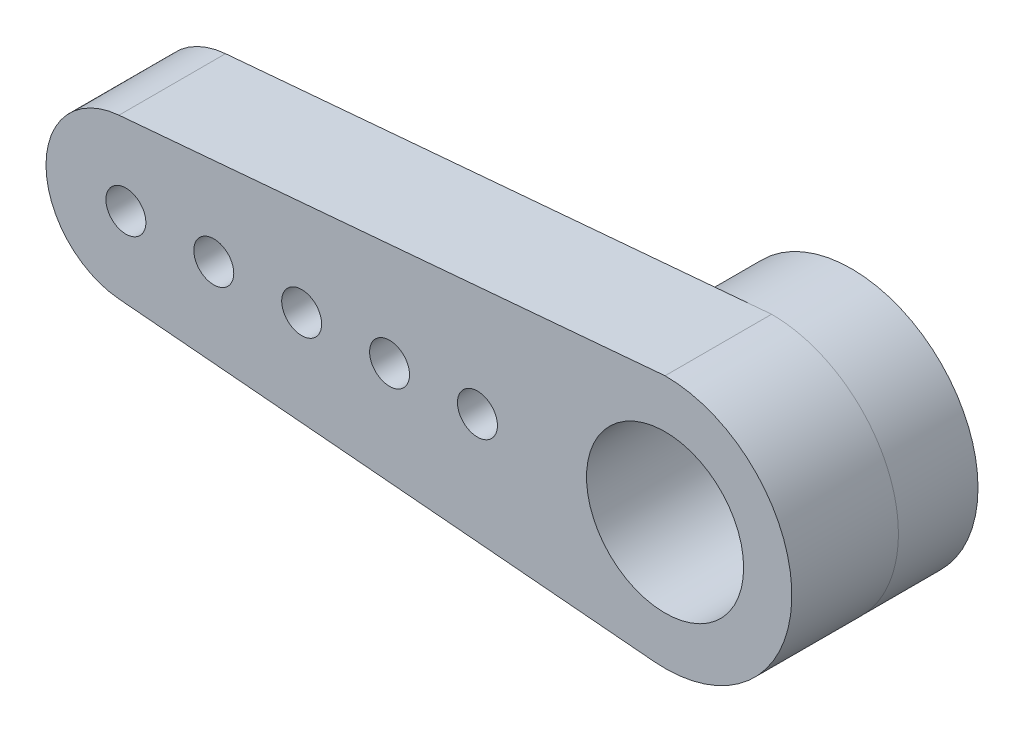
ISO-10303-21;
HEADER;
FILE_DESCRIPTION(('STEP AP214'),'2;1');
FILE_NAME('part.step','',(''),(''),'','','');
FILE_SCHEMA(('AUTOMOTIVE_DESIGN { 1 0 10303 214 1 1 1 1 }'));
ENDSEC;
DATA;
#1=APPLICATION_CONTEXT('core data for automotive mechanical design processes');
#2=APPLICATION_PROTOCOL_DEFINITION('international standard','automotive_design',2000,#1);
#3=PRODUCT_CONTEXT('',#1,'mechanical');
#4=PRODUCT('Part','Part','',(#3));
#5=PRODUCT_RELATED_PRODUCT_CATEGORY('part','',(#4));
#6=PRODUCT_DEFINITION_FORMATION('','',#4);
#7=PRODUCT_DEFINITION_CONTEXT('part definition',#1,'design');
#8=PRODUCT_DEFINITION('design','',#6,#7);
#9=PRODUCT_DEFINITION_SHAPE('','',#8);
#10=(LENGTH_UNIT() NAMED_UNIT(*) SI_UNIT(.MILLI.,.METRE.));
#11=(NAMED_UNIT(*) PLANE_ANGLE_UNIT() SI_UNIT($,.RADIAN.));
#12=(NAMED_UNIT(*) SI_UNIT($,.STERADIAN.) SOLID_ANGLE_UNIT());
#13=UNCERTAINTY_MEASURE_WITH_UNIT(LENGTH_MEASURE(1.E-05),#10,'distance_accuracy_value','');
#14=(GEOMETRIC_REPRESENTATION_CONTEXT(3) GLOBAL_UNCERTAINTY_ASSIGNED_CONTEXT((#13)) GLOBAL_UNIT_ASSIGNED_CONTEXT((#10,
#11,#12)) REPRESENTATION_CONTEXT('',''));
#15=CARTESIAN_POINT('',(0.,0.,0.));
#16=DIRECTION('',(0.,0.,1.));
#17=DIRECTION('',(1.,0.,0.));
#18=AXIS2_PLACEMENT_3D('',#15,#16,#17);
#19=CARTESIAN_POINT('',(0.000772804097320617,0.0089066542155656,-4.));
#20=DIRECTION('',(0.,0.,1.));
#21=DIRECTION('',(-1.,0.,0.));
#22=AXIS2_PLACEMENT_3D('',#19,#20,#21);
#23=PLANE('',#22);
#24=CARTESIAN_POINT('',(0.,0.,-4.));
#25=DIRECTION('',(0.,0.,1.));
#26=DIRECTION('',(1.,0.,0.));
#27=AXIS2_PLACEMENT_3D('',#24,#25,#26);
#28=CIRCLE('',#27,4.75);
#29=CARTESIAN_POINT('',(-0.41060076979759,4.73222009292062,-4.));
#30=VERTEX_POINT('',#29);
#31=CARTESIAN_POINT('',(-0.410600769797589,-4.73222009292062,-4.));
#32=VERTEX_POINT('',#31);
#33=EDGE_CURVE('E54',#30,#32,#28,.T.);
#34=ORIENTED_EDGE('',*,*,#33,.T.);
#35=DIRECTION('',(0.996256861667498,-0.0864422673258083,0.));
#36=VECTOR('',#35,1.);
#37=CARTESIAN_POINT('',(-20.504052607284,-2.9887705850025,-4.));
#38=LINE('',#37,#36);
#39=CARTESIAN_POINT('',(-20.504052607284,-2.9887705850025,-4.));
#40=VERTEX_POINT('',#39);
#41=EDGE_CURVE('E157',#40,#32,#38,.T.);
#42=ORIENTED_EDGE('',*,*,#41,.F.);
#43=CARTESIAN_POINT('',(-20.2447258053066,0.,-4.));
#44=DIRECTION('',(0.,0.,1.));
#45=DIRECTION('',(1.,0.,0.));
#46=AXIS2_PLACEMENT_3D('',#43,#44,#45);
#47=CIRCLE('',#46,3.);
#48=CARTESIAN_POINT('',(-20.504052607284,2.9887705850025,-4.));
#49=VERTEX_POINT('',#48);
#50=EDGE_CURVE('E101',#49,#40,#47,.T.);
#51=ORIENTED_EDGE('',*,*,#50,.F.);
#52=DIRECTION('',(-0.996256861667499,-0.0864422673258083,0.));
#53=VECTOR('',#52,1.);
#54=CARTESIAN_POINT('',(0.,4.76784670978288,-4.));
#55=LINE('',#54,#53);
#56=EDGE_CURVE('E98',#30,#49,#55,.T.);
#57=ORIENTED_EDGE('',*,*,#56,.F.);
#58=EDGE_LOOP('',(#34,#42,#51,#57));
#59=FACE_BOUND('',#58,.T.);
#60=CARTESIAN_POINT('',(-16.9447258053066,0.,-4.));
#61=DIRECTION('',(0.,0.,1.));
#62=DIRECTION('',(1.,0.,0.));
#63=AXIS2_PLACEMENT_3D('',#60,#61,#62);
#64=CIRCLE('',#63,0.750000000000002);
#65=CARTESIAN_POINT('',(-16.1947258053066,0.,-4.));
#66=VERTEX_POINT('',#65);
#67=EDGE_CURVE('E145',#66,#66,#64,.T.);
#68=ORIENTED_EDGE('',*,*,#67,.T.);
#69=EDGE_LOOP('',(#68));
#70=FACE_BOUND('',#69,.T.);
#71=CARTESIAN_POINT('',(-13.6447258053066,0.,-4.));
#72=DIRECTION('',(0.,0.,1.));
#73=DIRECTION('',(1.,0.,0.));
#74=AXIS2_PLACEMENT_3D('',#71,#72,#73);
#75=CIRCLE('',#74,0.750000000000002);
#76=CARTESIAN_POINT('',(-12.8947258053066,0.,-4.));
#77=VERTEX_POINT('',#76);
#78=EDGE_CURVE('E139',#77,#77,#75,.T.);
#79=ORIENTED_EDGE('',*,*,#78,.T.);
#80=EDGE_LOOP('',(#79));
#81=FACE_BOUND('',#80,.T.);
#82=CARTESIAN_POINT('',(-20.2447258053066,0.,-4.));
#83=DIRECTION('',(0.,0.,1.));
#84=DIRECTION('',(1.,0.,0.));
#85=AXIS2_PLACEMENT_3D('',#82,#83,#84);
#86=CIRCLE('',#85,0.750000000000002);
#87=CARTESIAN_POINT('',(-19.4947258053066,0.,-4.));
#88=VERTEX_POINT('',#87);
#89=EDGE_CURVE('E133',#88,#88,#86,.T.);
#90=ORIENTED_EDGE('',*,*,#89,.T.);
#91=EDGE_LOOP('',(#90));
#92=FACE_BOUND('',#91,.T.);
#93=CARTESIAN_POINT('',(-10.3447258053066,0.,-4.));
#94=DIRECTION('',(0.,0.,1.));
#95=DIRECTION('',(1.,0.,0.));
#96=AXIS2_PLACEMENT_3D('',#93,#94,#95);
#97=CIRCLE('',#96,0.750000000000002);
#98=CARTESIAN_POINT('',(-9.59472580530658,0.,-4.));
#99=VERTEX_POINT('',#98);
#100=EDGE_CURVE('E127',#99,#99,#97,.T.);
#101=ORIENTED_EDGE('',*,*,#100,.T.);
#102=EDGE_LOOP('',(#101));
#103=FACE_BOUND('',#102,.T.);
#104=CARTESIAN_POINT('',(-7.04472580530658,0.,-4.));
#105=DIRECTION('',(0.,0.,1.));
#106=DIRECTION('',(1.,0.,0.));
#107=AXIS2_PLACEMENT_3D('',#104,#105,#106);
#108=CIRCLE('',#107,0.750000000000002);
#109=CARTESIAN_POINT('',(-6.29472580530657,0.,-4.));
#110=VERTEX_POINT('',#109);
#111=EDGE_CURVE('E121',#110,#110,#108,.T.);
#112=ORIENTED_EDGE('',*,*,#111,.T.);
#113=EDGE_LOOP('',(#112));
#114=FACE_BOUND('',#113,.T.);
#115=ADVANCED_FACE('F43',(#59,#70,#81,#92,#103,#114),#23,.F.);
#116=EDGE_CURVE('E11',#32,#30,#28,.T.);
#117=ORIENTED_EDGE('',*,*,#116,.T.);
#118=CARTESIAN_POINT('',(0.,4.76784670978288,-4.));
#119=VERTEX_POINT('',#118);
#120=EDGE_CURVE('E95',#119,#30,#55,.T.);
#121=ORIENTED_EDGE('',*,*,#120,.F.);
#122=CARTESIAN_POINT('',(0.000772804097320617,0.0089066542155656,-4.));
#123=DIRECTION('',(0.,0.,1.));
#124=DIRECTION('',(-1.,0.,0.));
#125=AXIS2_PLACEMENT_3D('',#122,#123,#124);
#126=CIRCLE('',#125,4.75894011831513);
#127=EDGE_CURVE('E105',#32,#119,#126,.T.);
#128=ORIENTED_EDGE('',*,*,#127,.F.);
#129=EDGE_LOOP('',(#117,#121,#128));
#130=FACE_BOUND('',#129,.T.);
#131=ADVANCED_FACE('F104',(#130),#23,.F.);
#132=CARTESIAN_POINT('',(0.000772804097320617,0.0089066542155656,0.));
#133=DIRECTION('',(0.,0.,1.));
#134=DIRECTION('',(-1.,0.,0.));
#135=AXIS2_PLACEMENT_3D('',#132,#133,#134);
#136=PLANE('',#135);
#137=CARTESIAN_POINT('',(-10.3447258053066,0.,0.));
#138=DIRECTION('',(0.,0.,1.));
#139=DIRECTION('',(1.,0.,0.));
#140=AXIS2_PLACEMENT_3D('',#137,#138,#139);
#141=CIRCLE('',#140,0.750000000000002);
#142=CARTESIAN_POINT('',(-9.59472580530658,0.,0.));
#143=VERTEX_POINT('',#142);
#144=EDGE_CURVE('E124',#143,#143,#141,.T.);
#145=ORIENTED_EDGE('',*,*,#144,.F.);
#146=EDGE_LOOP('',(#145));
#147=FACE_BOUND('',#146,.T.);
#148=CARTESIAN_POINT('',(-13.6447258053066,0.,0.));
#149=DIRECTION('',(0.,0.,1.));
#150=DIRECTION('',(1.,0.,0.));
#151=AXIS2_PLACEMENT_3D('',#148,#149,#150);
#152=CIRCLE('',#151,0.750000000000002);
#153=CARTESIAN_POINT('',(-12.8947258053066,0.,0.));
#154=VERTEX_POINT('',#153);
#155=EDGE_CURVE('E136',#154,#154,#152,.T.);
#156=ORIENTED_EDGE('',*,*,#155,.F.);
#157=EDGE_LOOP('',(#156));
#158=FACE_BOUND('',#157,.T.);
#159=CARTESIAN_POINT('',(0.,0.,0.));
#160=DIRECTION('',(0.,0.,1.));
#161=DIRECTION('',(1.,0.,0.));
#162=AXIS2_PLACEMENT_3D('',#159,#160,#161);
#163=CIRCLE('',#162,2.95);
#164=CARTESIAN_POINT('',(2.95,0.,0.));
#165=VERTEX_POINT('',#164);
#166=EDGE_CURVE('E148',#165,#165,#163,.T.);
#167=ORIENTED_EDGE('',*,*,#166,.F.);
#168=EDGE_LOOP('',(#167));
#169=FACE_BOUND('',#168,.T.);
#170=CARTESIAN_POINT('',(0.000772804097320617,0.0089066542155656,0.));
#171=DIRECTION('',(0.,0.,1.));
#172=DIRECTION('',(-1.,0.,0.));
#173=AXIS2_PLACEMENT_3D('',#170,#171,#172);
#174=CIRCLE('',#173,4.75894011831513);
#175=CARTESIAN_POINT('',(-0.410600769797589,-4.73222009292062,0.));
#176=VERTEX_POINT('',#175);
#177=CARTESIAN_POINT('',(0.,4.76784670978288,0.));
#178=VERTEX_POINT('',#177);
#179=EDGE_CURVE('E153',#176,#178,#174,.T.);
#180=ORIENTED_EDGE('',*,*,#179,.T.);
#181=DIRECTION('',(-0.996256861667499,-0.0864422673258083,0.));
#182=VECTOR('',#181,1.);
#183=CARTESIAN_POINT('',(0.,4.76784670978288,0.));
#184=LINE('',#183,#182);
#185=CARTESIAN_POINT('',(-20.504052607284,2.9887705850025,0.));
#186=VERTEX_POINT('',#185);
#187=EDGE_CURVE('E161',#178,#186,#184,.T.);
#188=ORIENTED_EDGE('',*,*,#187,.T.);
#189=CARTESIAN_POINT('',(-20.2447258053066,0.,0.));
#190=DIRECTION('',(0.,0.,1.));
#191=DIRECTION('',(1.,0.,0.));
#192=AXIS2_PLACEMENT_3D('',#189,#190,#191);
#193=CIRCLE('',#192,3.);
#194=CARTESIAN_POINT('',(-20.504052607284,-2.9887705850025,0.));
#195=VERTEX_POINT('',#194);
#196=EDGE_CURVE('E164',#186,#195,#193,.T.);
#197=ORIENTED_EDGE('',*,*,#196,.T.);
#198=DIRECTION('',(0.996256861667498,-0.0864422673258083,0.));
#199=VECTOR('',#198,1.);
#200=CARTESIAN_POINT('',(-20.504052607284,-2.9887705850025,0.));
#201=LINE('',#200,#199);
#202=EDGE_CURVE('E154',#195,#176,#201,.T.);
#203=ORIENTED_EDGE('',*,*,#202,.T.);
#204=EDGE_LOOP('',(#180,#188,#197,#203));
#205=FACE_BOUND('',#204,.T.);
#206=CARTESIAN_POINT('',(-16.9447258053066,0.,0.));
#207=DIRECTION('',(0.,0.,1.));
#208=DIRECTION('',(1.,0.,0.));
#209=AXIS2_PLACEMENT_3D('',#206,#207,#208);
#210=CIRCLE('',#209,0.750000000000002);
#211=CARTESIAN_POINT('',(-16.1947258053066,0.,0.));
#212=VERTEX_POINT('',#211);
#213=EDGE_CURVE('E142',#212,#212,#210,.T.);
#214=ORIENTED_EDGE('',*,*,#213,.F.);
#215=EDGE_LOOP('',(#214));
#216=FACE_BOUND('',#215,.T.);
#217=CARTESIAN_POINT('',(-20.2447258053066,0.,0.));
#218=DIRECTION('',(0.,0.,1.));
#219=DIRECTION('',(1.,0.,0.));
#220=AXIS2_PLACEMENT_3D('',#217,#218,#219);
#221=CIRCLE('',#220,0.750000000000002);
#222=CARTESIAN_POINT('',(-19.4947258053066,0.,0.));
#223=VERTEX_POINT('',#222);
#224=EDGE_CURVE('E130',#223,#223,#221,.T.);
#225=ORIENTED_EDGE('',*,*,#224,.F.);
#226=EDGE_LOOP('',(#225));
#227=FACE_BOUND('',#226,.T.);
#228=CARTESIAN_POINT('',(-7.04472580530658,0.,0.));
#229=DIRECTION('',(0.,0.,1.));
#230=DIRECTION('',(1.,0.,0.));
#231=AXIS2_PLACEMENT_3D('',#228,#229,#230);
#232=CIRCLE('',#231,0.750000000000002);
#233=CARTESIAN_POINT('',(-6.29472580530657,0.,0.));
#234=VERTEX_POINT('',#233);
#235=EDGE_CURVE('E116',#234,#234,#232,.T.);
#236=ORIENTED_EDGE('',*,*,#235,.F.);
#237=EDGE_LOOP('',(#236));
#238=FACE_BOUND('',#237,.T.);
#239=ADVANCED_FACE('F171',(#147,#158,#169,#205,#216,#227,#238),#136,.T.);
#240=CARTESIAN_POINT('',(0.000772804097320617,0.0089066542155656,-4.));
#241=DIRECTION('',(0.,0.,1.));
#242=DIRECTION('',(-1.,0.,0.));
#243=AXIS2_PLACEMENT_3D('',#240,#241,#242);
#244=CYLINDRICAL_SURFACE('',#243,4.75894011831513);
#245=ORIENTED_EDGE('',*,*,#179,.F.);
#246=DIRECTION('',(0.,0.,1.));
#247=VECTOR('',#246,1.);
#248=CARTESIAN_POINT('',(-0.410600769797589,-4.73222009292062,-4.));
#249=LINE('',#248,#247);
#250=EDGE_CURVE('E62',#32,#176,#249,.T.);
#251=ORIENTED_EDGE('',*,*,#250,.F.);
#252=ORIENTED_EDGE('',*,*,#127,.T.);
#253=DIRECTION('',(0.,0.,1.));
#254=VECTOR('',#253,1.);
#255=CARTESIAN_POINT('',(0.,4.76784670978288,-4.));
#256=LINE('',#255,#254);
#257=EDGE_CURVE('E47',#119,#178,#256,.T.);
#258=ORIENTED_EDGE('',*,*,#257,.T.);
#259=EDGE_LOOP('',(#245,#251,#252,#258));
#260=FACE_BOUND('',#259,.T.);
#261=ADVANCED_FACE('F45',(#260),#244,.T.);
#262=CARTESIAN_POINT('',(0.,4.76784670978288,-4.));
#263=DIRECTION('',(0.0864422673258083,-0.996256861667499,0.));
#264=DIRECTION('',(0.996256861667499,0.0864422673258083,0.));
#265=AXIS2_PLACEMENT_3D('',#262,#263,#264);
#266=PLANE('',#265);
#267=ORIENTED_EDGE('',*,*,#187,.F.);
#268=ORIENTED_EDGE('',*,*,#257,.F.);
#269=ORIENTED_EDGE('',*,*,#120,.T.);
#270=ORIENTED_EDGE('',*,*,#56,.T.);
#271=DIRECTION('',(0.,0.,1.));
#272=VECTOR('',#271,1.);
#273=CARTESIAN_POINT('',(-20.504052607284,2.9887705850025,-4.));
#274=LINE('',#273,#272);
#275=EDGE_CURVE('E169',#49,#186,#274,.T.);
#276=ORIENTED_EDGE('',*,*,#275,.T.);
#277=EDGE_LOOP('',(#267,#268,#269,#270,#276));
#278=FACE_BOUND('',#277,.T.);
#279=ADVANCED_FACE('F96',(#278),#266,.F.);
#280=CARTESIAN_POINT('',(-20.2447258053066,0.,-4.));
#281=DIRECTION('',(0.,0.,1.));
#282=DIRECTION('',(-1.,0.,0.));
#283=AXIS2_PLACEMENT_3D('',#280,#281,#282);
#284=CYLINDRICAL_SURFACE('',#283,3.);
#285=ORIENTED_EDGE('',*,*,#196,.F.);
#286=ORIENTED_EDGE('',*,*,#275,.F.);
#287=ORIENTED_EDGE('',*,*,#50,.T.);
#288=DIRECTION('',(0.,0.,1.));
#289=VECTOR('',#288,1.);
#290=CARTESIAN_POINT('',(-20.504052607284,-2.9887705850025,-4.));
#291=LINE('',#290,#289);
#292=EDGE_CURVE('E80',#40,#195,#291,.T.);
#293=ORIENTED_EDGE('',*,*,#292,.T.);
#294=EDGE_LOOP('',(#285,#286,#287,#293));
#295=FACE_BOUND('',#294,.T.);
#296=ADVANCED_FACE('F174',(#295),#284,.T.);
#297=CARTESIAN_POINT('',(-20.504052607284,-2.9887705850025,-4.));
#298=DIRECTION('',(0.0864422673258083,0.996256861667499,0.));
#299=DIRECTION('',(-0.996256861667499,0.0864422673258083,0.));
#300=AXIS2_PLACEMENT_3D('',#297,#298,#299);
#301=PLANE('',#300);
#302=ORIENTED_EDGE('',*,*,#202,.F.);
#303=ORIENTED_EDGE('',*,*,#292,.F.);
#304=ORIENTED_EDGE('',*,*,#41,.T.);
#305=ORIENTED_EDGE('',*,*,#250,.T.);
#306=EDGE_LOOP('',(#302,#303,#304,#305));
#307=FACE_BOUND('',#306,.T.);
#308=ADVANCED_FACE('F173',(#307),#301,.F.);
#309=CARTESIAN_POINT('',(0.,0.,-4.));
#310=DIRECTION('',(0.,0.,1.));
#311=DIRECTION('',(-1.,0.,0.));
#312=AXIS2_PLACEMENT_3D('',#309,#310,#311);
#313=CYLINDRICAL_SURFACE('',#312,2.95);
#314=ORIENTED_EDGE('',*,*,#166,.T.);
#315=EDGE_LOOP('',(#314));
#316=FACE_BOUND('',#315,.T.);
#317=CARTESIAN_POINT('',(0.,0.,-7.));
#318=DIRECTION('',(0.,0.,1.));
#319=DIRECTION('',(1.,0.,0.));
#320=AXIS2_PLACEMENT_3D('',#317,#318,#319);
#321=CIRCLE('',#320,2.95);
#322=CARTESIAN_POINT('',(2.95,0.,-7.));
#323=VERTEX_POINT('',#322);
#324=EDGE_CURVE('E114',#323,#323,#321,.T.);
#325=ORIENTED_EDGE('',*,*,#324,.F.);
#326=EDGE_LOOP('',(#325));
#327=FACE_BOUND('',#326,.T.);
#328=ADVANCED_FACE('F181',(#316,#327),#313,.F.);
#329=CARTESIAN_POINT('',(-16.9447258053066,0.,-4.));
#330=DIRECTION('',(0.,0.,1.));
#331=DIRECTION('',(-1.,0.,0.));
#332=AXIS2_PLACEMENT_3D('',#329,#330,#331);
#333=CYLINDRICAL_SURFACE('',#332,0.750000000000002);
#334=ORIENTED_EDGE('',*,*,#67,.F.);
#335=EDGE_LOOP('',(#334));
#336=FACE_BOUND('',#335,.T.);
#337=ORIENTED_EDGE('',*,*,#213,.T.);
#338=EDGE_LOOP('',(#337));
#339=FACE_BOUND('',#338,.T.);
#340=ADVANCED_FACE('F204',(#336,#339),#333,.F.);
#341=CARTESIAN_POINT('',(-13.6447258053066,0.,-4.));
#342=DIRECTION('',(0.,0.,1.));
#343=DIRECTION('',(-1.,0.,0.));
#344=AXIS2_PLACEMENT_3D('',#341,#342,#343);
#345=CYLINDRICAL_SURFACE('',#344,0.750000000000002);
#346=ORIENTED_EDGE('',*,*,#78,.F.);
#347=EDGE_LOOP('',(#346));
#348=FACE_BOUND('',#347,.T.);
#349=ORIENTED_EDGE('',*,*,#155,.T.);
#350=EDGE_LOOP('',(#349));
#351=FACE_BOUND('',#350,.T.);
#352=ADVANCED_FACE('F229',(#348,#351),#345,.F.);
#353=CARTESIAN_POINT('',(-20.2447258053066,0.,-4.));
#354=DIRECTION('',(0.,0.,1.));
#355=DIRECTION('',(-1.,0.,0.));
#356=AXIS2_PLACEMENT_3D('',#353,#354,#355);
#357=CYLINDRICAL_SURFACE('',#356,0.750000000000002);
#358=ORIENTED_EDGE('',*,*,#89,.F.);
#359=EDGE_LOOP('',(#358));
#360=FACE_BOUND('',#359,.T.);
#361=ORIENTED_EDGE('',*,*,#224,.T.);
#362=EDGE_LOOP('',(#361));
#363=FACE_BOUND('',#362,.T.);
#364=ADVANCED_FACE('F225',(#360,#363),#357,.F.);
#365=CARTESIAN_POINT('',(-10.3447258053066,0.,-4.));
#366=DIRECTION('',(0.,0.,1.));
#367=DIRECTION('',(-1.,0.,0.));
#368=AXIS2_PLACEMENT_3D('',#365,#366,#367);
#369=CYLINDRICAL_SURFACE('',#368,0.750000000000002);
#370=ORIENTED_EDGE('',*,*,#100,.F.);
#371=EDGE_LOOP('',(#370));
#372=FACE_BOUND('',#371,.T.);
#373=ORIENTED_EDGE('',*,*,#144,.T.);
#374=EDGE_LOOP('',(#373));
#375=FACE_BOUND('',#374,.T.);
#376=ADVANCED_FACE('F218',(#372,#375),#369,.F.);
#377=CARTESIAN_POINT('',(-7.04472580530658,0.,-4.));
#378=DIRECTION('',(0.,0.,1.));
#379=DIRECTION('',(-1.,0.,0.));
#380=AXIS2_PLACEMENT_3D('',#377,#378,#379);
#381=CYLINDRICAL_SURFACE('',#380,0.750000000000002);
#382=ORIENTED_EDGE('',*,*,#111,.F.);
#383=EDGE_LOOP('',(#382));
#384=FACE_BOUND('',#383,.T.);
#385=ORIENTED_EDGE('',*,*,#235,.T.);
#386=EDGE_LOOP('',(#385));
#387=FACE_BOUND('',#386,.T.);
#388=ADVANCED_FACE('F209',(#384,#387),#381,.F.);
#389=CARTESIAN_POINT('',(0.,0.,-7.));
#390=DIRECTION('',(0.,0.,-1.));
#391=DIRECTION('',(1.,0.,0.));
#392=AXIS2_PLACEMENT_3D('',#389,#390,#391);
#393=PLANE('',#392);
#394=CARTESIAN_POINT('',(0.,0.,-7.));
#395=DIRECTION('',(0.,0.,1.));
#396=DIRECTION('',(1.,0.,0.));
#397=AXIS2_PLACEMENT_3D('',#394,#395,#396);
#398=CIRCLE('',#397,4.75);
#399=CARTESIAN_POINT('',(4.75,0.,-7.));
#400=VERTEX_POINT('',#399);
#401=EDGE_CURVE('E113',#400,#400,#398,.T.);
#402=ORIENTED_EDGE('',*,*,#401,.F.);
#403=EDGE_LOOP('',(#402));
#404=FACE_BOUND('',#403,.T.);
#405=ORIENTED_EDGE('',*,*,#324,.T.);
#406=EDGE_LOOP('',(#405));
#407=FACE_BOUND('',#406,.T.);
#408=ADVANCED_FACE('F207',(#404,#407),#393,.T.);
#409=CARTESIAN_POINT('',(0.,0.,-7.));
#410=DIRECTION('',(0.,0.,1.));
#411=DIRECTION('',(-1.,0.,0.));
#412=AXIS2_PLACEMENT_3D('',#409,#410,#411);
#413=CYLINDRICAL_SURFACE('',#412,4.75);
#414=ORIENTED_EDGE('',*,*,#401,.T.);
#415=EDGE_LOOP('',(#414));
#416=FACE_BOUND('',#415,.T.);
#417=ORIENTED_EDGE('',*,*,#33,.F.);
#418=ORIENTED_EDGE('',*,*,#116,.F.);
#419=EDGE_LOOP('',(#417,#418));
#420=FACE_BOUND('',#419,.T.);
#421=ADVANCED_FACE('F112',(#416,#420),#413,.T.);
#422=CLOSED_SHELL('',(#115,#131,#239,#261,#279,#296,#308,#328,#340,#352,#364,#376,#388,#408,#421));
#423=MANIFOLD_SOLID_BREP('B2',#422);
#424=ADVANCED_BREP_SHAPE_REPRESENTATION('',(#18,#423),#14);
#425=SHAPE_DEFINITION_REPRESENTATION(#9,#424);
ENDSEC;
END-ISO-10303-21;
